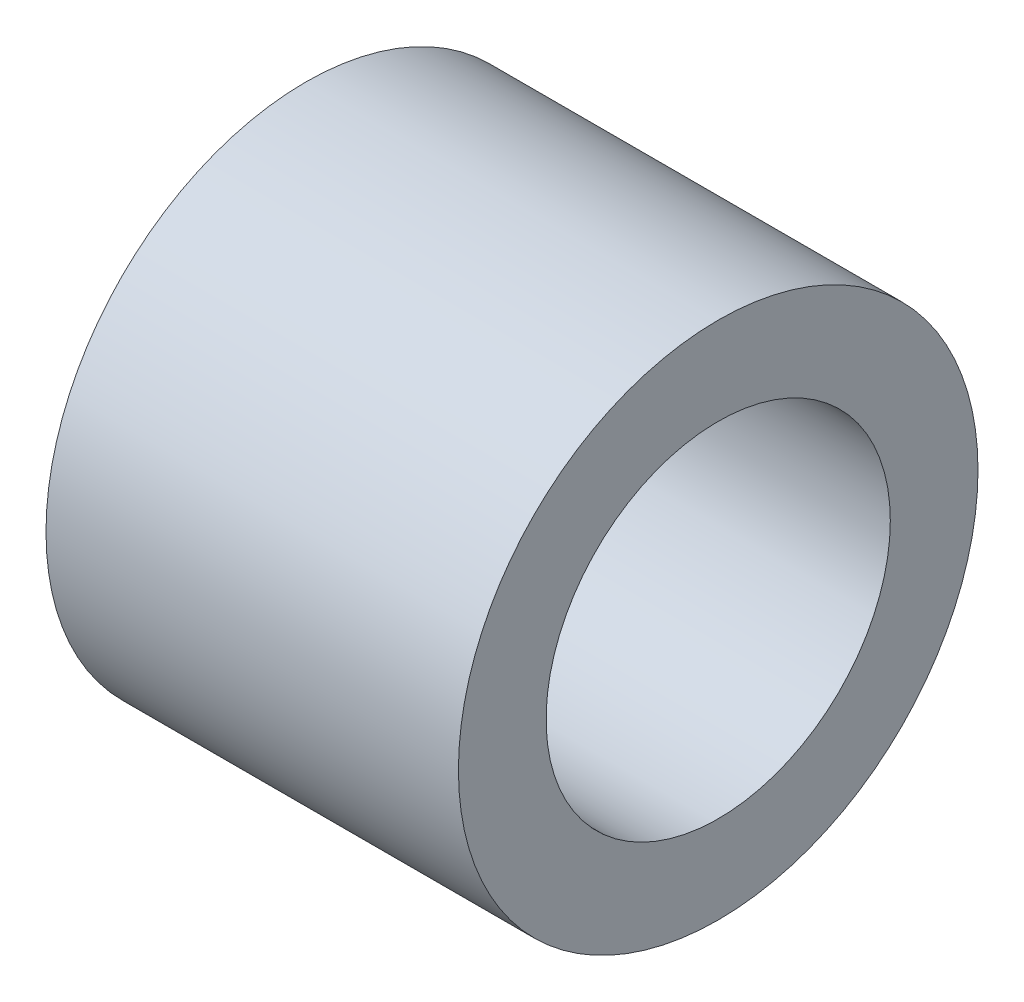
ISO-10303-21;
HEADER;
FILE_DESCRIPTION(('STEP AP214'),'2;1');
FILE_NAME('part.step','',(''),(''),'','','');
FILE_SCHEMA(('AUTOMOTIVE_DESIGN { 1 0 10303 214 1 1 1 1 }'));
ENDSEC;
DATA;
#1=APPLICATION_CONTEXT('core data for automotive mechanical design processes');
#2=APPLICATION_PROTOCOL_DEFINITION('international standard','automotive_design',2000,#1);
#3=PRODUCT_CONTEXT('',#1,'mechanical');
#4=PRODUCT('Part','Part','',(#3));
#5=PRODUCT_RELATED_PRODUCT_CATEGORY('part','',(#4));
#6=PRODUCT_DEFINITION_FORMATION('','',#4);
#7=PRODUCT_DEFINITION_CONTEXT('part definition',#1,'design');
#8=PRODUCT_DEFINITION('design','',#6,#7);
#9=PRODUCT_DEFINITION_SHAPE('','',#8);
#10=(LENGTH_UNIT() NAMED_UNIT(*) SI_UNIT(.MILLI.,.METRE.));
#11=(NAMED_UNIT(*) PLANE_ANGLE_UNIT() SI_UNIT($,.RADIAN.));
#12=(NAMED_UNIT(*) SI_UNIT($,.STERADIAN.) SOLID_ANGLE_UNIT());
#13=UNCERTAINTY_MEASURE_WITH_UNIT(LENGTH_MEASURE(1.E-05),#10,'distance_accuracy_value','');
#14=(GEOMETRIC_REPRESENTATION_CONTEXT(3) GLOBAL_UNCERTAINTY_ASSIGNED_CONTEXT((#13)) GLOBAL_UNIT_ASSIGNED_CONTEXT((#10,
#11,#12)) REPRESENTATION_CONTEXT('',''));
#15=CARTESIAN_POINT('',(0.,0.,0.));
#16=DIRECTION('',(0.,0.,1.));
#17=DIRECTION('',(1.,0.,0.));
#18=AXIS2_PLACEMENT_3D('',#15,#16,#17);
#19=CARTESIAN_POINT('',(6.35,0.,0.));
#20=DIRECTION('',(1.,0.,0.));
#21=DIRECTION('',(0.,0.,-1.));
#22=AXIS2_PLACEMENT_3D('',#19,#20,#21);
#23=PLANE('',#22);
#24=CARTESIAN_POINT('',(6.35,0.,0.));
#25=DIRECTION('',(1.,0.,0.));
#26=DIRECTION('',(0.,0.,-1.));
#27=AXIS2_PLACEMENT_3D('',#24,#25,#26);
#28=CIRCLE('',#27,4.);
#29=CARTESIAN_POINT('',(6.35,0.,-4.));
#30=VERTEX_POINT('',#29);
#31=EDGE_CURVE('E10',#30,#30,#28,.T.);
#32=ORIENTED_EDGE('',*,*,#31,.T.);
#33=EDGE_LOOP('',(#32));
#34=FACE_BOUND('',#33,.T.);
#35=CARTESIAN_POINT('',(6.35,0.,0.));
#36=DIRECTION('',(1.,0.,0.));
#37=DIRECTION('',(0.,0.,-1.));
#38=AXIS2_PLACEMENT_3D('',#35,#36,#37);
#39=CIRCLE('',#38,2.65);
#40=CARTESIAN_POINT('',(6.35,0.,-2.65));
#41=VERTEX_POINT('',#40);
#42=EDGE_CURVE('E43',#41,#41,#39,.T.);
#43=ORIENTED_EDGE('',*,*,#42,.F.);
#44=EDGE_LOOP('',(#43));
#45=FACE_BOUND('',#44,.T.);
#46=ADVANCED_FACE('F32',(#34,#45),#23,.T.);
#47=CARTESIAN_POINT('',(0.,0.,0.));
#48=DIRECTION('',(1.,0.,0.));
#49=DIRECTION('',(0.,0.,-1.));
#50=AXIS2_PLACEMENT_3D('',#47,#48,#49);
#51=PLANE('',#50);
#52=CARTESIAN_POINT('',(0.,0.,0.));
#53=DIRECTION('',(1.,0.,0.));
#54=DIRECTION('',(0.,0.,-1.));
#55=AXIS2_PLACEMENT_3D('',#52,#53,#54);
#56=CIRCLE('',#55,4.);
#57=CARTESIAN_POINT('',(0.,0.,-4.));
#58=VERTEX_POINT('',#57);
#59=EDGE_CURVE('E36',#58,#58,#56,.T.);
#60=ORIENTED_EDGE('',*,*,#59,.F.);
#61=EDGE_LOOP('',(#60));
#62=FACE_BOUND('',#61,.T.);
#63=CARTESIAN_POINT('',(0.,0.,0.));
#64=DIRECTION('',(1.,0.,0.));
#65=DIRECTION('',(0.,0.,-1.));
#66=AXIS2_PLACEMENT_3D('',#63,#64,#65);
#67=CIRCLE('',#66,2.65);
#68=CARTESIAN_POINT('',(0.,0.,-2.65));
#69=VERTEX_POINT('',#68);
#70=EDGE_CURVE('E45',#69,#69,#67,.T.);
#71=ORIENTED_EDGE('',*,*,#70,.T.);
#72=EDGE_LOOP('',(#71));
#73=FACE_BOUND('',#72,.T.);
#74=ADVANCED_FACE('F55',(#62,#73),#51,.F.);
#75=CARTESIAN_POINT('',(6.35,0.,0.));
#76=DIRECTION('',(-1.,0.,0.));
#77=DIRECTION('',(0.,0.,1.));
#78=AXIS2_PLACEMENT_3D('',#75,#76,#77);
#79=CYLINDRICAL_SURFACE('',#78,4.);
#80=ORIENTED_EDGE('',*,*,#31,.F.);
#81=EDGE_LOOP('',(#80));
#82=FACE_BOUND('',#81,.T.);
#83=ORIENTED_EDGE('',*,*,#59,.T.);
#84=EDGE_LOOP('',(#83));
#85=FACE_BOUND('',#84,.T.);
#86=ADVANCED_FACE('F34',(#82,#85),#79,.T.);
#87=CARTESIAN_POINT('',(6.35,0.,0.));
#88=DIRECTION('',(-1.,0.,0.));
#89=DIRECTION('',(0.,0.,1.));
#90=AXIS2_PLACEMENT_3D('',#87,#88,#89);
#91=CYLINDRICAL_SURFACE('',#90,2.65);
#92=ORIENTED_EDGE('',*,*,#42,.T.);
#93=EDGE_LOOP('',(#92));
#94=FACE_BOUND('',#93,.T.);
#95=ORIENTED_EDGE('',*,*,#70,.F.);
#96=EDGE_LOOP('',(#95));
#97=FACE_BOUND('',#96,.T.);
#98=ADVANCED_FACE('F51',(#94,#97),#91,.F.);
#99=CLOSED_SHELL('',(#46,#74,#86,#98));
#100=MANIFOLD_SOLID_BREP('B2',#99);
#101=ADVANCED_BREP_SHAPE_REPRESENTATION('',(#18,#100),#14);
#102=SHAPE_DEFINITION_REPRESENTATION(#9,#101);
ENDSEC;
END-ISO-10303-21;
